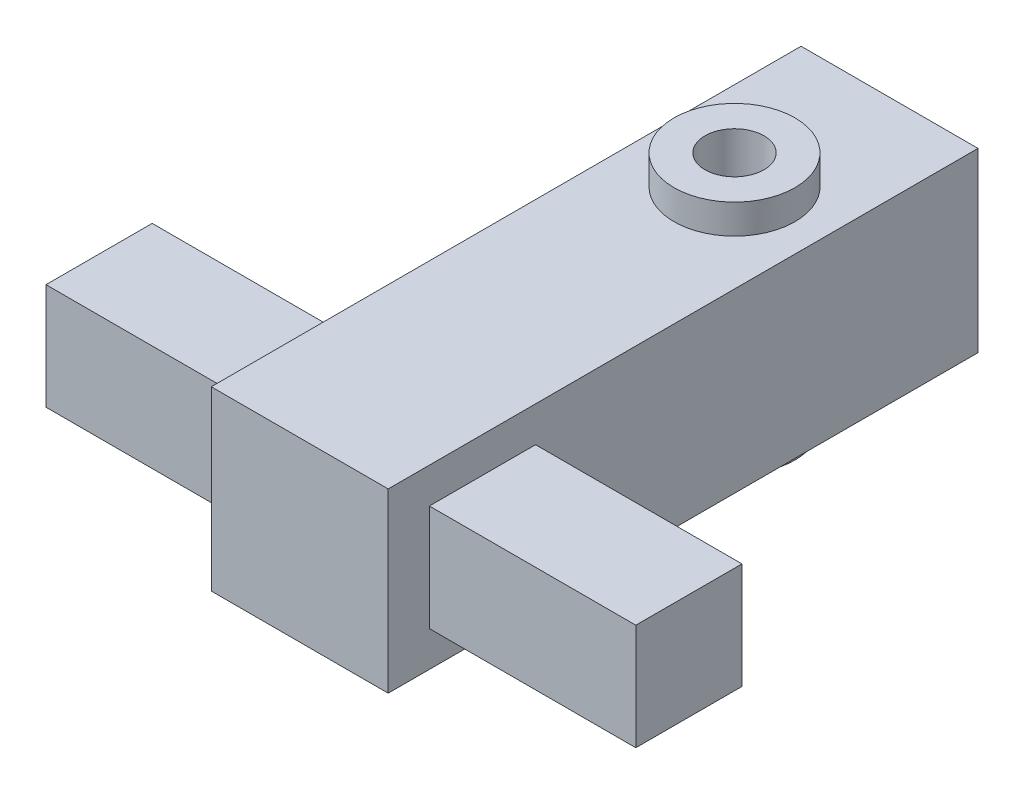
ISO-10303-21;
HEADER;
FILE_DESCRIPTION(('STEP AP214'),'2;1');
FILE_NAME('part.step','',(''),(''),'','','');
FILE_SCHEMA(('AUTOMOTIVE_DESIGN { 1 0 10303 214 1 1 1 1 }'));
ENDSEC;
DATA;
#1=APPLICATION_CONTEXT('core data for automotive mechanical design processes');
#2=APPLICATION_PROTOCOL_DEFINITION('international standard','automotive_design',2000,#1);
#3=PRODUCT_CONTEXT('',#1,'mechanical');
#4=PRODUCT('Part','Part','',(#3));
#5=PRODUCT_RELATED_PRODUCT_CATEGORY('part','',(#4));
#6=PRODUCT_DEFINITION_FORMATION('','',#4);
#7=PRODUCT_DEFINITION_CONTEXT('part definition',#1,'design');
#8=PRODUCT_DEFINITION('design','',#6,#7);
#9=PRODUCT_DEFINITION_SHAPE('','',#8);
#10=(LENGTH_UNIT() NAMED_UNIT(*) SI_UNIT(.MILLI.,.METRE.));
#11=(NAMED_UNIT(*) PLANE_ANGLE_UNIT() SI_UNIT($,.RADIAN.));
#12=(NAMED_UNIT(*) SI_UNIT($,.STERADIAN.) SOLID_ANGLE_UNIT());
#13=UNCERTAINTY_MEASURE_WITH_UNIT(LENGTH_MEASURE(1.E-05),#10,'distance_accuracy_value','');
#14=(GEOMETRIC_REPRESENTATION_CONTEXT(3) GLOBAL_UNCERTAINTY_ASSIGNED_CONTEXT((#13)) GLOBAL_UNIT_ASSIGNED_CONTEXT((#10,
#11,#12)) REPRESENTATION_CONTEXT('',''));
#15=CARTESIAN_POINT('',(0.,0.,0.));
#16=DIRECTION('',(0.,0.,1.));
#17=DIRECTION('',(1.,0.,0.));
#18=AXIS2_PLACEMENT_3D('',#15,#16,#17);
#19=CARTESIAN_POINT('',(-15.,-15.,100.));
#20=DIRECTION('',(1.,0.,0.));
#21=DIRECTION('',(0.,0.,-1.));
#22=AXIS2_PLACEMENT_3D('',#19,#20,#21);
#23=PLANE('',#22);
#24=DIRECTION('',(0.,-1.,0.));
#25=VECTOR('',#24,1.);
#26=CARTESIAN_POINT('',(-15.,-15.,0.));
#27=LINE('',#26,#25);
#28=CARTESIAN_POINT('',(-15.,15.,0.));
#29=VERTEX_POINT('',#28);
#30=CARTESIAN_POINT('',(-15.,-15.,0.));
#31=VERTEX_POINT('',#30);
#32=EDGE_CURVE('E197',#29,#31,#27,.T.);
#33=ORIENTED_EDGE('',*,*,#32,.T.);
#34=DIRECTION('',(0.,0.,-1.));
#35=VECTOR('',#34,1.);
#36=CARTESIAN_POINT('',(-15.,-15.,100.));
#37=LINE('',#36,#35);
#38=CARTESIAN_POINT('',(-15.,-15.,100.));
#39=VERTEX_POINT('',#38);
#40=EDGE_CURVE('E202',#39,#31,#37,.T.);
#41=ORIENTED_EDGE('',*,*,#40,.F.);
#42=DIRECTION('',(0.,-1.,0.));
#43=VECTOR('',#42,1.);
#44=CARTESIAN_POINT('',(-15.,-15.,100.));
#45=LINE('',#44,#43);
#46=CARTESIAN_POINT('',(-15.,15.,100.));
#47=VERTEX_POINT('',#46);
#48=EDGE_CURVE('E188',#47,#39,#45,.T.);
#49=ORIENTED_EDGE('',*,*,#48,.F.);
#50=DIRECTION('',(0.,0.,-1.));
#51=VECTOR('',#50,1.);
#52=CARTESIAN_POINT('',(-15.,15.,100.));
#53=LINE('',#52,#51);
#54=EDGE_CURVE('E205',#47,#29,#53,.T.);
#55=ORIENTED_EDGE('',*,*,#54,.T.);
#56=EDGE_LOOP('',(#33,#41,#49,#55));
#57=FACE_BOUND('',#56,.T.);
#58=DIRECTION('',(0.,1.,0.));
#59=VECTOR('',#58,1.);
#60=CARTESIAN_POINT('',(-15.,-8.99999999999997,93.0190009044477));
#61=LINE('',#60,#59);
#62=CARTESIAN_POINT('',(-15.,-8.99999999999997,93.0190009044477));
#63=VERTEX_POINT('',#62);
#64=CARTESIAN_POINT('',(-15.,9.00000000000003,93.0190009044477));
#65=VERTEX_POINT('',#64);
#66=EDGE_CURVE('E142',#63,#65,#61,.T.);
#67=ORIENTED_EDGE('',*,*,#66,.F.);
#68=DIRECTION('',(0.,0.,1.));
#69=VECTOR('',#68,1.);
#70=CARTESIAN_POINT('',(-15.,-8.99999999999997,75.0190009044477));
#71=LINE('',#70,#69);
#72=CARTESIAN_POINT('',(-15.,-8.99999999999997,75.0190009044477));
#73=VERTEX_POINT('',#72);
#74=EDGE_CURVE('E139',#73,#63,#71,.T.);
#75=ORIENTED_EDGE('',*,*,#74,.F.);
#76=DIRECTION('',(0.,-1.,0.));
#77=VECTOR('',#76,1.);
#78=CARTESIAN_POINT('',(-15.,-8.99999999999997,75.0190009044477));
#79=LINE('',#78,#77);
#80=CARTESIAN_POINT('',(-15.,9.00000000000003,75.0190009044477));
#81=VERTEX_POINT('',#80);
#82=EDGE_CURVE('E53',#81,#73,#79,.T.);
#83=ORIENTED_EDGE('',*,*,#82,.F.);
#84=DIRECTION('',(0.,0.,-1.));
#85=VECTOR('',#84,1.);
#86=CARTESIAN_POINT('',(-15.,9.00000000000003,75.0190009044477));
#87=LINE('',#86,#85);
#88=EDGE_CURVE('E48',#65,#81,#87,.T.);
#89=ORIENTED_EDGE('',*,*,#88,.F.);
#90=EDGE_LOOP('',(#67,#75,#83,#89));
#91=FACE_BOUND('',#90,.T.);
#92=ADVANCED_FACE('F33',(#57,#91),#23,.F.);
#93=CARTESIAN_POINT('',(15.,-15.,100.));
#94=DIRECTION('',(-1.,0.,0.));
#95=DIRECTION('',(0.,0.,1.));
#96=AXIS2_PLACEMENT_3D('',#93,#94,#95);
#97=PLANE('',#96);
#98=DIRECTION('',(0.,1.,0.));
#99=VECTOR('',#98,1.);
#100=CARTESIAN_POINT('',(15.,-15.,0.));
#101=LINE('',#100,#99);
#102=CARTESIAN_POINT('',(15.,-15.,0.));
#103=VERTEX_POINT('',#102);
#104=CARTESIAN_POINT('',(15.,15.,0.));
#105=VERTEX_POINT('',#104);
#106=EDGE_CURVE('E181',#103,#105,#101,.T.);
#107=ORIENTED_EDGE('',*,*,#106,.T.);
#108=DIRECTION('',(0.,0.,-1.));
#109=VECTOR('',#108,1.);
#110=CARTESIAN_POINT('',(15.,15.,100.));
#111=LINE('',#110,#109);
#112=CARTESIAN_POINT('',(15.,15.,100.));
#113=VERTEX_POINT('',#112);
#114=EDGE_CURVE('E208',#113,#105,#111,.T.);
#115=ORIENTED_EDGE('',*,*,#114,.F.);
#116=DIRECTION('',(0.,1.,0.));
#117=VECTOR('',#116,1.);
#118=CARTESIAN_POINT('',(15.,-15.,100.));
#119=LINE('',#118,#117);
#120=CARTESIAN_POINT('',(15.,-15.,100.));
#121=VERTEX_POINT('',#120);
#122=EDGE_CURVE('E182',#121,#113,#119,.T.);
#123=ORIENTED_EDGE('',*,*,#122,.F.);
#124=DIRECTION('',(0.,0.,-1.));
#125=VECTOR('',#124,1.);
#126=CARTESIAN_POINT('',(15.,-15.,100.));
#127=LINE('',#126,#125);
#128=EDGE_CURVE('E192',#121,#103,#127,.T.);
#129=ORIENTED_EDGE('',*,*,#128,.T.);
#130=EDGE_LOOP('',(#107,#115,#123,#129));
#131=FACE_BOUND('',#130,.T.);
#132=DIRECTION('',(0.,-1.,0.));
#133=VECTOR('',#132,1.);
#134=CARTESIAN_POINT('',(15.,8.99999999999997,93.0190009044477));
#135=LINE('',#134,#133);
#136=CARTESIAN_POINT('',(15.,8.99999999999997,93.0190009044477));
#137=VERTEX_POINT('',#136);
#138=CARTESIAN_POINT('',(15.,-9.00000000000003,93.0190009044477));
#139=VERTEX_POINT('',#138);
#140=EDGE_CURVE('E143',#137,#139,#135,.T.);
#141=ORIENTED_EDGE('',*,*,#140,.F.);
#142=DIRECTION('',(0.,0.,1.));
#143=VECTOR('',#142,1.);
#144=CARTESIAN_POINT('',(15.,8.99999999999997,75.0190009044477));
#145=LINE('',#144,#143);
#146=CARTESIAN_POINT('',(15.,8.99999999999997,75.0190009044477));
#147=VERTEX_POINT('',#146);
#148=EDGE_CURVE('E156',#147,#137,#145,.T.);
#149=ORIENTED_EDGE('',*,*,#148,.F.);
#150=DIRECTION('',(0.,1.,0.));
#151=VECTOR('',#150,1.);
#152=CARTESIAN_POINT('',(15.,8.99999999999997,75.0190009044477));
#153=LINE('',#152,#151);
#154=CARTESIAN_POINT('',(15.,-9.00000000000003,75.0190009044477));
#155=VERTEX_POINT('',#154);
#156=EDGE_CURVE('E165',#155,#147,#153,.T.);
#157=ORIENTED_EDGE('',*,*,#156,.F.);
#158=DIRECTION('',(0.,0.,-1.));
#159=VECTOR('',#158,1.);
#160=CARTESIAN_POINT('',(15.,-9.00000000000003,75.0190009044477));
#161=LINE('',#160,#159);
#162=EDGE_CURVE('E146',#139,#155,#161,.T.);
#163=ORIENTED_EDGE('',*,*,#162,.F.);
#164=EDGE_LOOP('',(#141,#149,#157,#163));
#165=FACE_BOUND('',#164,.T.);
#166=ADVANCED_FACE('F35',(#131,#165),#97,.F.);
#167=CARTESIAN_POINT('',(-15.,15.,100.));
#168=DIRECTION('',(0.,-1.,0.));
#169=DIRECTION('',(0.,0.,-1.));
#170=AXIS2_PLACEMENT_3D('',#167,#168,#169);
#171=PLANE('',#170);
#172=CARTESIAN_POINT('',(0.,15.,26.2853853099614));
#173=DIRECTION('',(0.,-1.,0.));
#174=DIRECTION('',(0.,0.,-1.));
#175=AXIS2_PLACEMENT_3D('',#172,#173,#174);
#176=CIRCLE('',#175,10.2542497165814);
#177=CARTESIAN_POINT('',(0.,15.,16.03113559338));
#178=VERTEX_POINT('',#177);
#179=EDGE_CURVE('E41',#178,#178,#176,.F.);
#180=ORIENTED_EDGE('',*,*,#179,.F.);
#181=EDGE_LOOP('',(#180));
#182=FACE_BOUND('',#181,.T.);
#183=DIRECTION('',(-1.,0.,0.));
#184=VECTOR('',#183,1.);
#185=CARTESIAN_POINT('',(-15.,15.,0.));
#186=LINE('',#185,#184);
#187=EDGE_CURVE('E195',#105,#29,#186,.T.);
#188=ORIENTED_EDGE('',*,*,#187,.T.);
#189=ORIENTED_EDGE('',*,*,#54,.F.);
#190=DIRECTION('',(-1.,0.,0.));
#191=VECTOR('',#190,1.);
#192=CARTESIAN_POINT('',(-15.,15.,100.));
#193=LINE('',#192,#191);
#194=EDGE_CURVE('E185',#113,#47,#193,.T.);
#195=ORIENTED_EDGE('',*,*,#194,.F.);
#196=ORIENTED_EDGE('',*,*,#114,.T.);
#197=EDGE_LOOP('',(#188,#189,#195,#196));
#198=FACE_BOUND('',#197,.T.);
#199=ADVANCED_FACE('F215',(#182,#198),#171,.F.);
#200=CARTESIAN_POINT('',(-15.,-15.,100.));
#201=DIRECTION('',(0.,1.,0.));
#202=DIRECTION('',(0.,0.,1.));
#203=AXIS2_PLACEMENT_3D('',#200,#201,#202);
#204=PLANE('',#203);
#205=CARTESIAN_POINT('',(0.,-15.,26.2853853099614));
#206=DIRECTION('',(0.,1.,0.));
#207=DIRECTION('',(0.,0.,1.));
#208=AXIS2_PLACEMENT_3D('',#205,#206,#207);
#209=CIRCLE('',#208,10.2542497165814);
#210=CARTESIAN_POINT('',(0.,-15.,36.5396350265428));
#211=VERTEX_POINT('',#210);
#212=EDGE_CURVE('E11',#211,#211,#209,.F.);
#213=ORIENTED_EDGE('',*,*,#212,.F.);
#214=EDGE_LOOP('',(#213));
#215=FACE_BOUND('',#214,.T.);
#216=DIRECTION('',(1.,0.,0.));
#217=VECTOR('',#216,1.);
#218=CARTESIAN_POINT('',(-15.,-15.,0.));
#219=LINE('',#218,#217);
#220=EDGE_CURVE('E186',#31,#103,#219,.T.);
#221=ORIENTED_EDGE('',*,*,#220,.T.);
#222=ORIENTED_EDGE('',*,*,#128,.F.);
#223=DIRECTION('',(1.,0.,0.));
#224=VECTOR('',#223,1.);
#225=CARTESIAN_POINT('',(-15.,-15.,100.));
#226=LINE('',#225,#224);
#227=EDGE_CURVE('E190',#39,#121,#226,.T.);
#228=ORIENTED_EDGE('',*,*,#227,.F.);
#229=ORIENTED_EDGE('',*,*,#40,.T.);
#230=EDGE_LOOP('',(#221,#222,#228,#229));
#231=FACE_BOUND('',#230,.T.);
#232=ADVANCED_FACE('F218',(#215,#231),#204,.F.);
#233=CARTESIAN_POINT('',(0.,0.,100.));
#234=DIRECTION('',(0.,0.,-1.));
#235=DIRECTION('',(-1.,0.,0.));
#236=AXIS2_PLACEMENT_3D('',#233,#234,#235);
#237=PLANE('',#236);
#238=ORIENTED_EDGE('',*,*,#122,.T.);
#239=ORIENTED_EDGE('',*,*,#194,.T.);
#240=ORIENTED_EDGE('',*,*,#48,.T.);
#241=ORIENTED_EDGE('',*,*,#227,.T.);
#242=EDGE_LOOP('',(#238,#239,#240,#241));
#243=FACE_BOUND('',#242,.T.);
#244=ADVANCED_FACE('F236',(#243),#237,.F.);
#245=CARTESIAN_POINT('',(0.,0.,0.));
#246=DIRECTION('',(0.,0.,-1.));
#247=DIRECTION('',(-1.,0.,0.));
#248=AXIS2_PLACEMENT_3D('',#245,#246,#247);
#249=PLANE('',#248);
#250=ORIENTED_EDGE('',*,*,#106,.F.);
#251=ORIENTED_EDGE('',*,*,#220,.F.);
#252=ORIENTED_EDGE('',*,*,#32,.F.);
#253=ORIENTED_EDGE('',*,*,#187,.F.);
#254=EDGE_LOOP('',(#250,#251,#252,#253));
#255=FACE_BOUND('',#254,.T.);
#256=ADVANCED_FACE('F228',(#255),#249,.T.);
#257=CARTESIAN_POINT('',(50.,8.99999999999997,93.0190009044477));
#258=DIRECTION('',(0.,0.,-1.));
#259=DIRECTION('',(-1.,0.,0.));
#260=AXIS2_PLACEMENT_3D('',#257,#258,#259);
#261=PLANE('',#260);
#262=ORIENTED_EDGE('',*,*,#140,.T.);
#263=DIRECTION('',(-1.,0.,0.));
#264=VECTOR('',#263,1.);
#265=CARTESIAN_POINT('',(50.,-9.00000000000003,93.0190009044477));
#266=LINE('',#265,#264);
#267=CARTESIAN_POINT('',(50.,-9.00000000000003,93.0190009044477));
#268=VERTEX_POINT('',#267);
#269=EDGE_CURVE('E178',#268,#139,#266,.T.);
#270=ORIENTED_EDGE('',*,*,#269,.F.);
#271=DIRECTION('',(0.,-1.,0.));
#272=VECTOR('',#271,1.);
#273=CARTESIAN_POINT('',(50.,8.99999999999997,93.0190009044477));
#274=LINE('',#273,#272);
#275=CARTESIAN_POINT('',(50.,8.99999999999997,93.0190009044477));
#276=VERTEX_POINT('',#275);
#277=EDGE_CURVE('E152',#276,#268,#274,.T.);
#278=ORIENTED_EDGE('',*,*,#277,.F.);
#279=DIRECTION('',(-1.,0.,0.));
#280=VECTOR('',#279,1.);
#281=CARTESIAN_POINT('',(50.,8.99999999999997,93.0190009044477));
#282=LINE('',#281,#280);
#283=EDGE_CURVE('E161',#276,#137,#282,.T.);
#284=ORIENTED_EDGE('',*,*,#283,.T.);
#285=EDGE_LOOP('',(#262,#270,#278,#284));
#286=FACE_BOUND('',#285,.T.);
#287=ADVANCED_FACE('F243',(#286),#261,.F.);
#288=CARTESIAN_POINT('',(50.,-9.00000000000003,75.0190009044477));
#289=DIRECTION('',(0.,1.,0.));
#290=DIRECTION('',(0.,0.,1.));
#291=AXIS2_PLACEMENT_3D('',#288,#289,#290);
#292=PLANE('',#291);
#293=ORIENTED_EDGE('',*,*,#162,.T.);
#294=DIRECTION('',(-1.,0.,0.));
#295=VECTOR('',#294,1.);
#296=CARTESIAN_POINT('',(50.,-9.00000000000003,75.0190009044477));
#297=LINE('',#296,#295);
#298=CARTESIAN_POINT('',(50.,-9.00000000000003,75.0190009044477));
#299=VERTEX_POINT('',#298);
#300=EDGE_CURVE('E175',#299,#155,#297,.T.);
#301=ORIENTED_EDGE('',*,*,#300,.F.);
#302=DIRECTION('',(0.,0.,-1.));
#303=VECTOR('',#302,1.);
#304=CARTESIAN_POINT('',(50.,-9.00000000000003,75.0190009044477));
#305=LINE('',#304,#303);
#306=EDGE_CURVE('E155',#268,#299,#305,.T.);
#307=ORIENTED_EDGE('',*,*,#306,.F.);
#308=ORIENTED_EDGE('',*,*,#269,.T.);
#309=EDGE_LOOP('',(#293,#301,#307,#308));
#310=FACE_BOUND('',#309,.T.);
#311=ADVANCED_FACE('F358',(#310),#292,.F.);
#312=CARTESIAN_POINT('',(50.,8.99999999999997,75.0190009044477));
#313=DIRECTION('',(0.,0.,1.));
#314=DIRECTION('',(1.,0.,0.));
#315=AXIS2_PLACEMENT_3D('',#312,#313,#314);
#316=PLANE('',#315);
#317=ORIENTED_EDGE('',*,*,#156,.T.);
#318=DIRECTION('',(-1.,0.,0.));
#319=VECTOR('',#318,1.);
#320=CARTESIAN_POINT('',(50.,8.99999999999997,75.0190009044477));
#321=LINE('',#320,#319);
#322=CARTESIAN_POINT('',(50.,8.99999999999997,75.0190009044477));
#323=VERTEX_POINT('',#322);
#324=EDGE_CURVE('E172',#323,#147,#321,.T.);
#325=ORIENTED_EDGE('',*,*,#324,.F.);
#326=DIRECTION('',(0.,1.,0.));
#327=VECTOR('',#326,1.);
#328=CARTESIAN_POINT('',(50.,8.99999999999997,75.0190009044477));
#329=LINE('',#328,#327);
#330=EDGE_CURVE('E158',#299,#323,#329,.T.);
#331=ORIENTED_EDGE('',*,*,#330,.F.);
#332=ORIENTED_EDGE('',*,*,#300,.T.);
#333=EDGE_LOOP('',(#317,#325,#331,#332));
#334=FACE_BOUND('',#333,.T.);
#335=ADVANCED_FACE('F354',(#334),#316,.F.);
#336=CARTESIAN_POINT('',(50.,8.99999999999997,75.0190009044477));
#337=DIRECTION('',(0.,-1.,0.));
#338=DIRECTION('',(0.,0.,-1.));
#339=AXIS2_PLACEMENT_3D('',#336,#337,#338);
#340=PLANE('',#339);
#341=ORIENTED_EDGE('',*,*,#148,.T.);
#342=ORIENTED_EDGE('',*,*,#283,.F.);
#343=DIRECTION('',(0.,0.,1.));
#344=VECTOR('',#343,1.);
#345=CARTESIAN_POINT('',(50.,8.99999999999997,75.0190009044477));
#346=LINE('',#345,#344);
#347=EDGE_CURVE('E160',#323,#276,#346,.T.);
#348=ORIENTED_EDGE('',*,*,#347,.F.);
#349=ORIENTED_EDGE('',*,*,#324,.T.);
#350=EDGE_LOOP('',(#341,#342,#348,#349));
#351=FACE_BOUND('',#350,.T.);
#352=ADVANCED_FACE('F350',(#351),#340,.F.);
#353=CARTESIAN_POINT('',(50.,0.,0.));
#354=DIRECTION('',(-1.,0.,0.));
#355=DIRECTION('',(0.,0.,1.));
#356=AXIS2_PLACEMENT_3D('',#353,#354,#355);
#357=PLANE('',#356);
#358=ORIENTED_EDGE('',*,*,#277,.T.);
#359=ORIENTED_EDGE('',*,*,#306,.T.);
#360=ORIENTED_EDGE('',*,*,#330,.T.);
#361=ORIENTED_EDGE('',*,*,#347,.T.);
#362=EDGE_LOOP('',(#358,#359,#360,#361));
#363=FACE_BOUND('',#362,.T.);
#364=ADVANCED_FACE('F347',(#363),#357,.F.);
#365=CARTESIAN_POINT('',(-50.,-8.99999999999997,93.0190009044477));
#366=DIRECTION('',(0.,0.,-1.));
#367=DIRECTION('',(-1.,0.,0.));
#368=AXIS2_PLACEMENT_3D('',#365,#366,#367);
#369=PLANE('',#368);
#370=ORIENTED_EDGE('',*,*,#66,.T.);
#371=DIRECTION('',(1.,0.,0.));
#372=VECTOR('',#371,1.);
#373=CARTESIAN_POINT('',(-50.,9.00000000000003,93.0190009044477));
#374=LINE('',#373,#372);
#375=CARTESIAN_POINT('',(-50.,9.00000000000003,93.0190009044477));
#376=VERTEX_POINT('',#375);
#377=EDGE_CURVE('E123',#376,#65,#374,.T.);
#378=ORIENTED_EDGE('',*,*,#377,.F.);
#379=DIRECTION('',(0.,1.,0.));
#380=VECTOR('',#379,1.);
#381=CARTESIAN_POINT('',(-50.,-8.99999999999997,93.0190009044477));
#382=LINE('',#381,#380);
#383=CARTESIAN_POINT('',(-50.,-8.99999999999997,93.0190009044477));
#384=VERTEX_POINT('',#383);
#385=EDGE_CURVE('E130',#384,#376,#382,.T.);
#386=ORIENTED_EDGE('',*,*,#385,.F.);
#387=DIRECTION('',(1.,0.,0.));
#388=VECTOR('',#387,1.);
#389=CARTESIAN_POINT('',(-50.,-8.99999999999997,93.0190009044477));
#390=LINE('',#389,#388);
#391=EDGE_CURVE('E466',#384,#63,#390,.T.);
#392=ORIENTED_EDGE('',*,*,#391,.T.);
#393=EDGE_LOOP('',(#370,#378,#386,#392));
#394=FACE_BOUND('',#393,.T.);
#395=ADVANCED_FACE('F141',(#394),#369,.F.);
#396=CARTESIAN_POINT('',(-50.,9.00000000000003,75.0190009044477));
#397=DIRECTION('',(0.,-1.,0.));
#398=DIRECTION('',(0.,0.,-1.));
#399=AXIS2_PLACEMENT_3D('',#396,#397,#398);
#400=PLANE('',#399);
#401=ORIENTED_EDGE('',*,*,#88,.T.);
#402=DIRECTION('',(1.,0.,0.));
#403=VECTOR('',#402,1.);
#404=CARTESIAN_POINT('',(-50.,9.00000000000003,75.0190009044477));
#405=LINE('',#404,#403);
#406=CARTESIAN_POINT('',(-50.,9.00000000000003,75.0190009044477));
#407=VERTEX_POINT('',#406);
#408=EDGE_CURVE('E126',#407,#81,#405,.T.);
#409=ORIENTED_EDGE('',*,*,#408,.F.);
#410=DIRECTION('',(0.,0.,-1.));
#411=VECTOR('',#410,1.);
#412=CARTESIAN_POINT('',(-50.,9.00000000000003,75.0190009044477));
#413=LINE('',#412,#411);
#414=EDGE_CURVE('E119',#376,#407,#413,.T.);
#415=ORIENTED_EDGE('',*,*,#414,.F.);
#416=ORIENTED_EDGE('',*,*,#377,.T.);
#417=EDGE_LOOP('',(#401,#409,#415,#416));
#418=FACE_BOUND('',#417,.T.);
#419=ADVANCED_FACE('F121',(#418),#400,.F.);
#420=CARTESIAN_POINT('',(-50.,-8.99999999999997,75.0190009044477));
#421=DIRECTION('',(0.,0.,1.));
#422=DIRECTION('',(1.,0.,0.));
#423=AXIS2_PLACEMENT_3D('',#420,#421,#422);
#424=PLANE('',#423);
#425=ORIENTED_EDGE('',*,*,#82,.T.);
#426=DIRECTION('',(1.,0.,0.));
#427=VECTOR('',#426,1.);
#428=CARTESIAN_POINT('',(-50.,-8.99999999999997,75.0190009044477));
#429=LINE('',#428,#427);
#430=CARTESIAN_POINT('',(-50.,-8.99999999999997,75.0190009044477));
#431=VERTEX_POINT('',#430);
#432=EDGE_CURVE('E148',#431,#73,#429,.T.);
#433=ORIENTED_EDGE('',*,*,#432,.F.);
#434=DIRECTION('',(0.,-1.,0.));
#435=VECTOR('',#434,1.);
#436=CARTESIAN_POINT('',(-50.,-8.99999999999997,75.0190009044477));
#437=LINE('',#436,#435);
#438=EDGE_CURVE('E129',#407,#431,#437,.T.);
#439=ORIENTED_EDGE('',*,*,#438,.F.);
#440=ORIENTED_EDGE('',*,*,#408,.T.);
#441=EDGE_LOOP('',(#425,#433,#439,#440));
#442=FACE_BOUND('',#441,.T.);
#443=ADVANCED_FACE('F338',(#442),#424,.F.);
#444=CARTESIAN_POINT('',(-50.,-8.99999999999997,75.0190009044477));
#445=DIRECTION('',(0.,1.,0.));
#446=DIRECTION('',(0.,0.,1.));
#447=AXIS2_PLACEMENT_3D('',#444,#445,#446);
#448=PLANE('',#447);
#449=ORIENTED_EDGE('',*,*,#74,.T.);
#450=ORIENTED_EDGE('',*,*,#391,.F.);
#451=DIRECTION('',(0.,0.,1.));
#452=VECTOR('',#451,1.);
#453=CARTESIAN_POINT('',(-50.,-8.99999999999997,75.0190009044477));
#454=LINE('',#453,#452);
#455=EDGE_CURVE('E135',#431,#384,#454,.T.);
#456=ORIENTED_EDGE('',*,*,#455,.F.);
#457=ORIENTED_EDGE('',*,*,#432,.T.);
#458=EDGE_LOOP('',(#449,#450,#456,#457));
#459=FACE_BOUND('',#458,.T.);
#460=ADVANCED_FACE('F335',(#459),#448,.F.);
#461=CARTESIAN_POINT('',(-50.,0.,0.));
#462=DIRECTION('',(1.,0.,0.));
#463=DIRECTION('',(0.,0.,1.));
#464=AXIS2_PLACEMENT_3D('',#461,#462,#463);
#465=PLANE('',#464);
#466=ORIENTED_EDGE('',*,*,#385,.T.);
#467=ORIENTED_EDGE('',*,*,#414,.T.);
#468=ORIENTED_EDGE('',*,*,#438,.T.);
#469=ORIENTED_EDGE('',*,*,#455,.T.);
#470=EDGE_LOOP('',(#466,#467,#468,#469));
#471=FACE_BOUND('',#470,.T.);
#472=ADVANCED_FACE('F133',(#471),#465,.F.);
#473=CARTESIAN_POINT('',(0.,20.,26.2853853099614));
#474=DIRECTION('',(0.,-1.,0.));
#475=DIRECTION('',(0.,0.,-1.));
#476=AXIS2_PLACEMENT_3D('',#473,#474,#475);
#477=CYLINDRICAL_SURFACE('',#476,10.2542497165814);
#478=CARTESIAN_POINT('',(0.,20.,26.2853853099614));
#479=DIRECTION('',(0.,1.,0.));
#480=DIRECTION('',(0.,0.,1.));
#481=AXIS2_PLACEMENT_3D('',#478,#479,#480);
#482=CIRCLE('',#481,10.2542497165814);
#483=CARTESIAN_POINT('',(0.,20.,36.5396350265428));
#484=VERTEX_POINT('',#483);
#485=EDGE_CURVE('E472',#484,#484,#482,.T.);
#486=ORIENTED_EDGE('',*,*,#485,.F.);
#487=EDGE_LOOP('',(#486));
#488=FACE_BOUND('',#487,.T.);
#489=ORIENTED_EDGE('',*,*,#179,.T.);
#490=EDGE_LOOP('',(#489));
#491=FACE_BOUND('',#490,.T.);
#492=ADVANCED_FACE('F213',(#488,#491),#477,.T.);
#493=CARTESIAN_POINT('',(0.,20.,26.2853853099614));
#494=DIRECTION('',(0.,1.,0.));
#495=DIRECTION('',(0.,0.,1.));
#496=AXIS2_PLACEMENT_3D('',#493,#494,#495);
#497=PLANE('',#496);
#498=CARTESIAN_POINT('',(0.,20.,26.2853853099614));
#499=DIRECTION('',(0.,1.,0.));
#500=DIRECTION('',(0.,0.,1.));
#501=AXIS2_PLACEMENT_3D('',#498,#499,#500);
#502=CIRCLE('',#501,5.);
#503=CARTESIAN_POINT('',(0.,20.,31.2853853099614));
#504=VERTEX_POINT('',#503);
#505=EDGE_CURVE('E478',#504,#504,#502,.T.);
#506=ORIENTED_EDGE('',*,*,#505,.F.);
#507=EDGE_LOOP('',(#506));
#508=FACE_BOUND('',#507,.T.);
#509=ORIENTED_EDGE('',*,*,#485,.T.);
#510=EDGE_LOOP('',(#509));
#511=FACE_BOUND('',#510,.T.);
#512=ADVANCED_FACE('F325',(#508,#511),#497,.T.);
#513=CARTESIAN_POINT('',(0.,5.,26.2853853099614));
#514=DIRECTION('',(0.,1.,0.));
#515=DIRECTION('',(0.,0.,1.));
#516=AXIS2_PLACEMENT_3D('',#513,#514,#515);
#517=CYLINDRICAL_SURFACE('',#516,5.);
#518=CARTESIAN_POINT('',(0.,5.,26.2853853099614));
#519=DIRECTION('',(0.,1.,0.));
#520=DIRECTION('',(0.,0.,1.));
#521=AXIS2_PLACEMENT_3D('',#518,#519,#520);
#522=CIRCLE('',#521,5.);
#523=CARTESIAN_POINT('',(0.,5.,31.2853853099614));
#524=VERTEX_POINT('',#523);
#525=EDGE_CURVE('E477',#524,#524,#522,.T.);
#526=ORIENTED_EDGE('',*,*,#525,.F.);
#527=EDGE_LOOP('',(#526));
#528=FACE_BOUND('',#527,.T.);
#529=ORIENTED_EDGE('',*,*,#505,.T.);
#530=EDGE_LOOP('',(#529));
#531=FACE_BOUND('',#530,.T.);
#532=ADVANCED_FACE('F321',(#528,#531),#517,.F.);
#533=CARTESIAN_POINT('',(0.,5.,26.2853853099614));
#534=DIRECTION('',(0.,1.,0.));
#535=DIRECTION('',(0.,0.,1.));
#536=AXIS2_PLACEMENT_3D('',#533,#534,#535);
#537=PLANE('',#536);
#538=ORIENTED_EDGE('',*,*,#525,.T.);
#539=EDGE_LOOP('',(#538));
#540=FACE_BOUND('',#539,.T.);
#541=ADVANCED_FACE('F274',(#540),#537,.T.);
#542=CARTESIAN_POINT('',(0.,-20.,26.2853853099614));
#543=DIRECTION('',(0.,1.,0.));
#544=DIRECTION('',(0.,0.,1.));
#545=AXIS2_PLACEMENT_3D('',#542,#543,#544);
#546=CYLINDRICAL_SURFACE('',#545,10.2542497165814);
#547=CARTESIAN_POINT('',(0.,-20.,26.2853853099614));
#548=DIRECTION('',(0.,-1.,0.));
#549=DIRECTION('',(0.,0.,1.));
#550=AXIS2_PLACEMENT_3D('',#547,#548,#549);
#551=CIRCLE('',#550,10.2542497165814);
#552=CARTESIAN_POINT('',(0.,-20.,36.5396350265428));
#553=VERTEX_POINT('',#552);
#554=EDGE_CURVE('E481',#553,#553,#551,.T.);
#555=ORIENTED_EDGE('',*,*,#554,.F.);
#556=EDGE_LOOP('',(#555));
#557=FACE_BOUND('',#556,.T.);
#558=ORIENTED_EDGE('',*,*,#212,.T.);
#559=EDGE_LOOP('',(#558));
#560=FACE_BOUND('',#559,.T.);
#561=ADVANCED_FACE('F279',(#557,#560),#546,.T.);
#562=CARTESIAN_POINT('',(0.,-20.,26.2853853099614));
#563=DIRECTION('',(0.,-1.,0.));
#564=DIRECTION('',(0.,0.,1.));
#565=AXIS2_PLACEMENT_3D('',#562,#563,#564);
#566=PLANE('',#565);
#567=CARTESIAN_POINT('',(0.,-20.,26.2853853099614));
#568=DIRECTION('',(0.,-1.,0.));
#569=DIRECTION('',(0.,0.,1.));
#570=AXIS2_PLACEMENT_3D('',#567,#568,#569);
#571=CIRCLE('',#570,5.);
#572=CARTESIAN_POINT('',(0.,-20.,31.2853853099614));
#573=VERTEX_POINT('',#572);
#574=EDGE_CURVE('E487',#573,#573,#571,.T.);
#575=ORIENTED_EDGE('',*,*,#574,.F.);
#576=EDGE_LOOP('',(#575));
#577=FACE_BOUND('',#576,.T.);
#578=ORIENTED_EDGE('',*,*,#554,.T.);
#579=EDGE_LOOP('',(#578));
#580=FACE_BOUND('',#579,.T.);
#581=ADVANCED_FACE('F284',(#577,#580),#566,.T.);
#582=CARTESIAN_POINT('',(0.,-5.,26.2853853099614));
#583=DIRECTION('',(0.,-1.,0.));
#584=DIRECTION('',(0.,0.,-1.));
#585=AXIS2_PLACEMENT_3D('',#582,#583,#584);
#586=CYLINDRICAL_SURFACE('',#585,5.);
#587=CARTESIAN_POINT('',(0.,-5.,26.2853853099614));
#588=DIRECTION('',(0.,-1.,0.));
#589=DIRECTION('',(0.,0.,1.));
#590=AXIS2_PLACEMENT_3D('',#587,#588,#589);
#591=CIRCLE('',#590,5.);
#592=CARTESIAN_POINT('',(0.,-5.,31.2853853099614));
#593=VERTEX_POINT('',#592);
#594=EDGE_CURVE('E486',#593,#593,#591,.T.);
#595=ORIENTED_EDGE('',*,*,#594,.F.);
#596=EDGE_LOOP('',(#595));
#597=FACE_BOUND('',#596,.T.);
#598=ORIENTED_EDGE('',*,*,#574,.T.);
#599=EDGE_LOOP('',(#598));
#600=FACE_BOUND('',#599,.T.);
#601=ADVANCED_FACE('F294',(#597,#600),#586,.F.);
#602=CARTESIAN_POINT('',(0.,-5.,26.2853853099614));
#603=DIRECTION('',(0.,-1.,0.));
#604=DIRECTION('',(0.,0.,1.));
#605=AXIS2_PLACEMENT_3D('',#602,#603,#604);
#606=PLANE('',#605);
#607=ORIENTED_EDGE('',*,*,#594,.T.);
#608=EDGE_LOOP('',(#607));
#609=FACE_BOUND('',#608,.T.);
#610=ADVANCED_FACE('F304',(#609),#606,.T.);
#611=CLOSED_SHELL('',(#92,#166,#199,#232,#244,#256,#287,#311,#335,#352,#364,#395,#419,#443,#460,
#472,#492,#512,#532,#541,#561,#581,#601,#610));
#612=MANIFOLD_SOLID_BREP('B2',#611);
#613=ADVANCED_BREP_SHAPE_REPRESENTATION('',(#18,#612),#14);
#614=SHAPE_DEFINITION_REPRESENTATION(#9,#613);
ENDSEC;
END-ISO-10303-21;
